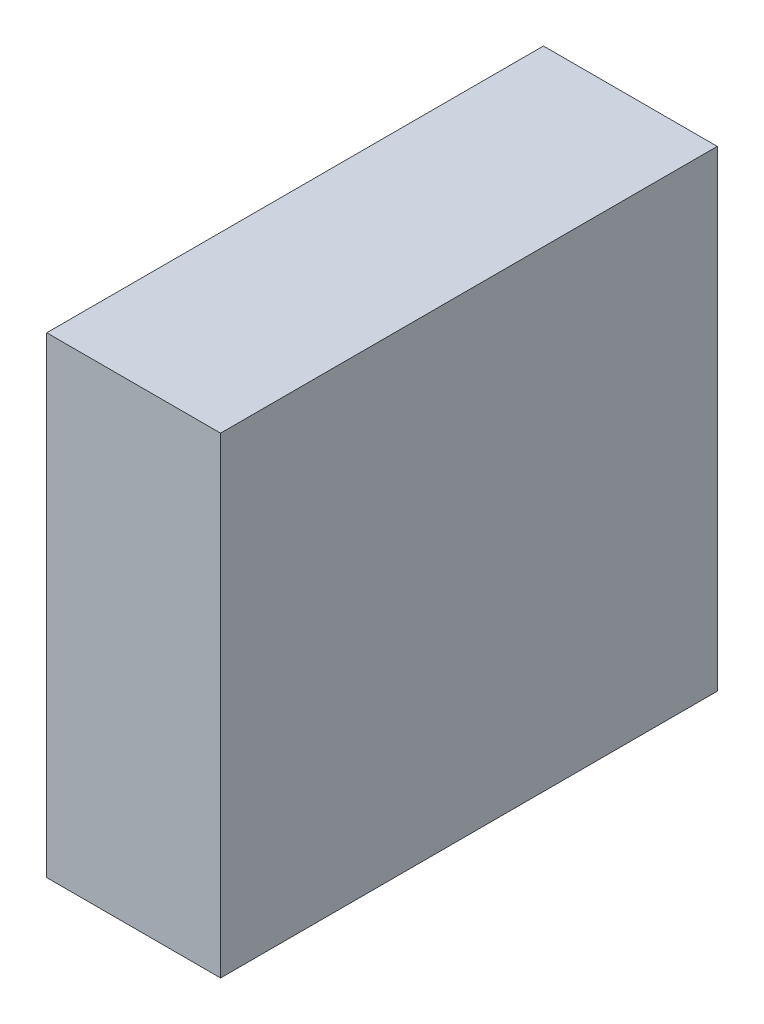
ISO-10303-21;
HEADER;
FILE_DESCRIPTION(('STEP AP214'),'2;1');
FILE_NAME('part.step','',(''),(''),'','','');
FILE_SCHEMA(('AUTOMOTIVE_DESIGN { 1 0 10303 214 1 1 1 1 }'));
ENDSEC;
DATA;
#1=APPLICATION_CONTEXT('core data for automotive mechanical design processes');
#2=APPLICATION_PROTOCOL_DEFINITION('international standard','automotive_design',2000,#1);
#3=PRODUCT_CONTEXT('',#1,'mechanical');
#4=PRODUCT('Part','Part','',(#3));
#5=PRODUCT_RELATED_PRODUCT_CATEGORY('part','',(#4));
#6=PRODUCT_DEFINITION_FORMATION('','',#4);
#7=PRODUCT_DEFINITION_CONTEXT('part definition',#1,'design');
#8=PRODUCT_DEFINITION('design','',#6,#7);
#9=PRODUCT_DEFINITION_SHAPE('','',#8);
#10=(LENGTH_UNIT() NAMED_UNIT(*) SI_UNIT(.MILLI.,.METRE.));
#11=(NAMED_UNIT(*) PLANE_ANGLE_UNIT() SI_UNIT($,.RADIAN.));
#12=(NAMED_UNIT(*) SI_UNIT($,.STERADIAN.) SOLID_ANGLE_UNIT());
#13=UNCERTAINTY_MEASURE_WITH_UNIT(LENGTH_MEASURE(1.E-05),#10,'distance_accuracy_value','');
#14=(GEOMETRIC_REPRESENTATION_CONTEXT(3) GLOBAL_UNCERTAINTY_ASSIGNED_CONTEXT((#13)) GLOBAL_UNIT_ASSIGNED_CONTEXT((#10,
#11,#12)) REPRESENTATION_CONTEXT('',''));
#15=CARTESIAN_POINT('',(0.,0.,0.));
#16=DIRECTION('',(0.,0.,1.));
#17=DIRECTION('',(1.,0.,0.));
#18=AXIS2_PLACEMENT_3D('',#15,#16,#17);
#19=CARTESIAN_POINT('',(0.17500092,-0.47499778,0.));
#20=DIRECTION('',(-1.,0.,0.));
#21=DIRECTION('',(0.,1.,0.));
#22=AXIS2_PLACEMENT_3D('',#19,#20,#21);
#23=PLANE('',#22);
#24=DIRECTION('',(0.,1.,0.));
#25=VECTOR('',#24,1.);
#26=CARTESIAN_POINT('',(0.17500092,-0.47499778,0.));
#27=LINE('',#26,#25);
#28=CARTESIAN_POINT('',(0.17500092,-0.47499778,0.));
#29=VERTEX_POINT('',#28);
#30=CARTESIAN_POINT('',(0.17500092,0.47500032,0.));
#31=VERTEX_POINT('',#30);
#32=EDGE_CURVE('E11',#29,#31,#27,.T.);
#33=ORIENTED_EDGE('',*,*,#32,.T.);
#34=DIRECTION('',(0.,0.,1.));
#35=VECTOR('',#34,1.);
#36=CARTESIAN_POINT('',(0.17500092,0.47500032,0.));
#37=LINE('',#36,#35);
#38=CARTESIAN_POINT('',(0.17500092,0.47500032,1.00000054));
#39=VERTEX_POINT('',#38);
#40=EDGE_CURVE('E24',#31,#39,#37,.T.);
#41=ORIENTED_EDGE('',*,*,#40,.T.);
#42=DIRECTION('',(0.,1.,0.));
#43=VECTOR('',#42,1.);
#44=CARTESIAN_POINT('',(0.17500092,-0.47499778,1.00000054));
#45=LINE('',#44,#43);
#46=CARTESIAN_POINT('',(0.17500092,-0.47499778,1.00000054));
#47=VERTEX_POINT('',#46);
#48=EDGE_CURVE('E87',#47,#39,#45,.T.);
#49=ORIENTED_EDGE('',*,*,#48,.F.);
#50=DIRECTION('',(0.,0.,1.));
#51=VECTOR('',#50,1.);
#52=CARTESIAN_POINT('',(0.17500092,-0.47499778,0.));
#53=LINE('',#52,#51);
#54=EDGE_CURVE('E36',#29,#47,#53,.T.);
#55=ORIENTED_EDGE('',*,*,#54,.F.);
#56=EDGE_LOOP('',(#33,#41,#49,#55));
#57=FACE_BOUND('',#56,.T.);
#58=ADVANCED_FACE('F17',(#57),#23,.F.);
#59=CARTESIAN_POINT('',(0.17500092,0.47500032,0.));
#60=DIRECTION('',(0.,-1.,0.));
#61=DIRECTION('',(-1.,0.,0.));
#62=AXIS2_PLACEMENT_3D('',#59,#60,#61);
#63=PLANE('',#62);
#64=DIRECTION('',(-1.,0.,0.));
#65=VECTOR('',#64,1.);
#66=CARTESIAN_POINT('',(0.17500092,0.47500032,0.));
#67=LINE('',#66,#65);
#68=CARTESIAN_POINT('',(-0.17500092,0.47500032,0.));
#69=VERTEX_POINT('',#68);
#70=EDGE_CURVE('E84',#31,#69,#67,.T.);
#71=ORIENTED_EDGE('',*,*,#70,.T.);
#72=DIRECTION('',(0.,0.,1.));
#73=VECTOR('',#72,1.);
#74=CARTESIAN_POINT('',(-0.17500092,0.47500032,0.));
#75=LINE('',#74,#73);
#76=CARTESIAN_POINT('',(-0.17500092,0.47500032,1.00000054));
#77=VERTEX_POINT('',#76);
#78=EDGE_CURVE('E82',#69,#77,#75,.T.);
#79=ORIENTED_EDGE('',*,*,#78,.T.);
#80=DIRECTION('',(-1.,0.,0.));
#81=VECTOR('',#80,1.);
#82=CARTESIAN_POINT('',(0.17500092,0.47500032,1.00000054));
#83=LINE('',#82,#81);
#84=EDGE_CURVE('E62',#39,#77,#83,.T.);
#85=ORIENTED_EDGE('',*,*,#84,.F.);
#86=ORIENTED_EDGE('',*,*,#40,.F.);
#87=EDGE_LOOP('',(#71,#79,#85,#86));
#88=FACE_BOUND('',#87,.T.);
#89=ADVANCED_FACE('F89',(#88),#63,.F.);
#90=CARTESIAN_POINT('',(-0.17500092,0.47500032,0.));
#91=DIRECTION('',(1.,0.,0.));
#92=DIRECTION('',(0.,-1.,0.));
#93=AXIS2_PLACEMENT_3D('',#90,#91,#92);
#94=PLANE('',#93);
#95=DIRECTION('',(0.,-1.,0.));
#96=VECTOR('',#95,1.);
#97=CARTESIAN_POINT('',(-0.17500092,0.47500032,0.));
#98=LINE('',#97,#96);
#99=CARTESIAN_POINT('',(-0.17500092,-0.47499778,0.));
#100=VERTEX_POINT('',#99);
#101=EDGE_CURVE('E71',#69,#100,#98,.T.);
#102=ORIENTED_EDGE('',*,*,#101,.T.);
#103=DIRECTION('',(0.,0.,1.));
#104=VECTOR('',#103,1.);
#105=CARTESIAN_POINT('',(-0.17500092,-0.47499778,0.));
#106=LINE('',#105,#104);
#107=CARTESIAN_POINT('',(-0.17500092,-0.47499778,1.00000054));
#108=VERTEX_POINT('',#107);
#109=EDGE_CURVE('E65',#100,#108,#106,.T.);
#110=ORIENTED_EDGE('',*,*,#109,.T.);
#111=DIRECTION('',(0.,-1.,0.));
#112=VECTOR('',#111,1.);
#113=CARTESIAN_POINT('',(-0.17500092,0.47500032,1.00000054));
#114=LINE('',#113,#112);
#115=EDGE_CURVE('E57',#77,#108,#114,.T.);
#116=ORIENTED_EDGE('',*,*,#115,.F.);
#117=ORIENTED_EDGE('',*,*,#78,.F.);
#118=EDGE_LOOP('',(#102,#110,#116,#117));
#119=FACE_BOUND('',#118,.T.);
#120=ADVANCED_FACE('F69',(#119),#94,.F.);
#121=CARTESIAN_POINT('',(-0.17500092,-0.47499778,0.));
#122=DIRECTION('',(0.,1.,0.));
#123=DIRECTION('',(1.,0.,0.));
#124=AXIS2_PLACEMENT_3D('',#121,#122,#123);
#125=PLANE('',#124);
#126=DIRECTION('',(1.,0.,0.));
#127=VECTOR('',#126,1.);
#128=CARTESIAN_POINT('',(-0.17500092,-0.47499778,0.));
#129=LINE('',#128,#127);
#130=EDGE_CURVE('E66',#100,#29,#129,.T.);
#131=ORIENTED_EDGE('',*,*,#130,.T.);
#132=ORIENTED_EDGE('',*,*,#54,.T.);
#133=DIRECTION('',(1.,0.,0.));
#134=VECTOR('',#133,1.);
#135=CARTESIAN_POINT('',(-0.17500092,-0.47499778,1.00000054));
#136=LINE('',#135,#134);
#137=EDGE_CURVE('E61',#108,#47,#136,.T.);
#138=ORIENTED_EDGE('',*,*,#137,.F.);
#139=ORIENTED_EDGE('',*,*,#109,.F.);
#140=EDGE_LOOP('',(#131,#132,#138,#139));
#141=FACE_BOUND('',#140,.T.);
#142=ADVANCED_FACE('F76',(#141),#125,.F.);
#143=CARTESIAN_POINT('',(0.17500092,-0.47499778,0.));
#144=DIRECTION('',(0.,0.,-1.));
#145=DIRECTION('',(-1.,0.,0.));
#146=AXIS2_PLACEMENT_3D('',#143,#144,#145);
#147=PLANE('',#146);
#148=ORIENTED_EDGE('',*,*,#130,.F.);
#149=ORIENTED_EDGE('',*,*,#101,.F.);
#150=ORIENTED_EDGE('',*,*,#70,.F.);
#151=ORIENTED_EDGE('',*,*,#32,.F.);
#152=EDGE_LOOP('',(#148,#149,#150,#151));
#153=FACE_BOUND('',#152,.T.);
#154=ADVANCED_FACE('F91',(#153),#147,.T.);
#155=CARTESIAN_POINT('',(0.17500092,-0.47499778,1.00000054));
#156=DIRECTION('',(0.,0.,-1.));
#157=DIRECTION('',(-1.,0.,0.));
#158=AXIS2_PLACEMENT_3D('',#155,#156,#157);
#159=PLANE('',#158);
#160=ORIENTED_EDGE('',*,*,#48,.T.);
#161=ORIENTED_EDGE('',*,*,#84,.T.);
#162=ORIENTED_EDGE('',*,*,#115,.T.);
#163=ORIENTED_EDGE('',*,*,#137,.T.);
#164=EDGE_LOOP('',(#160,#161,#162,#163));
#165=FACE_BOUND('',#164,.T.);
#166=ADVANCED_FACE('F59',(#165),#159,.F.);
#167=CLOSED_SHELL('',(#58,#89,#120,#142,#154,#166));
#168=MANIFOLD_SOLID_BREP('B1',#167);
#169=ADVANCED_BREP_SHAPE_REPRESENTATION('',(#18,#168),#14);
#170=SHAPE_DEFINITION_REPRESENTATION(#9,#169);
ENDSEC;
END-ISO-10303-21;
